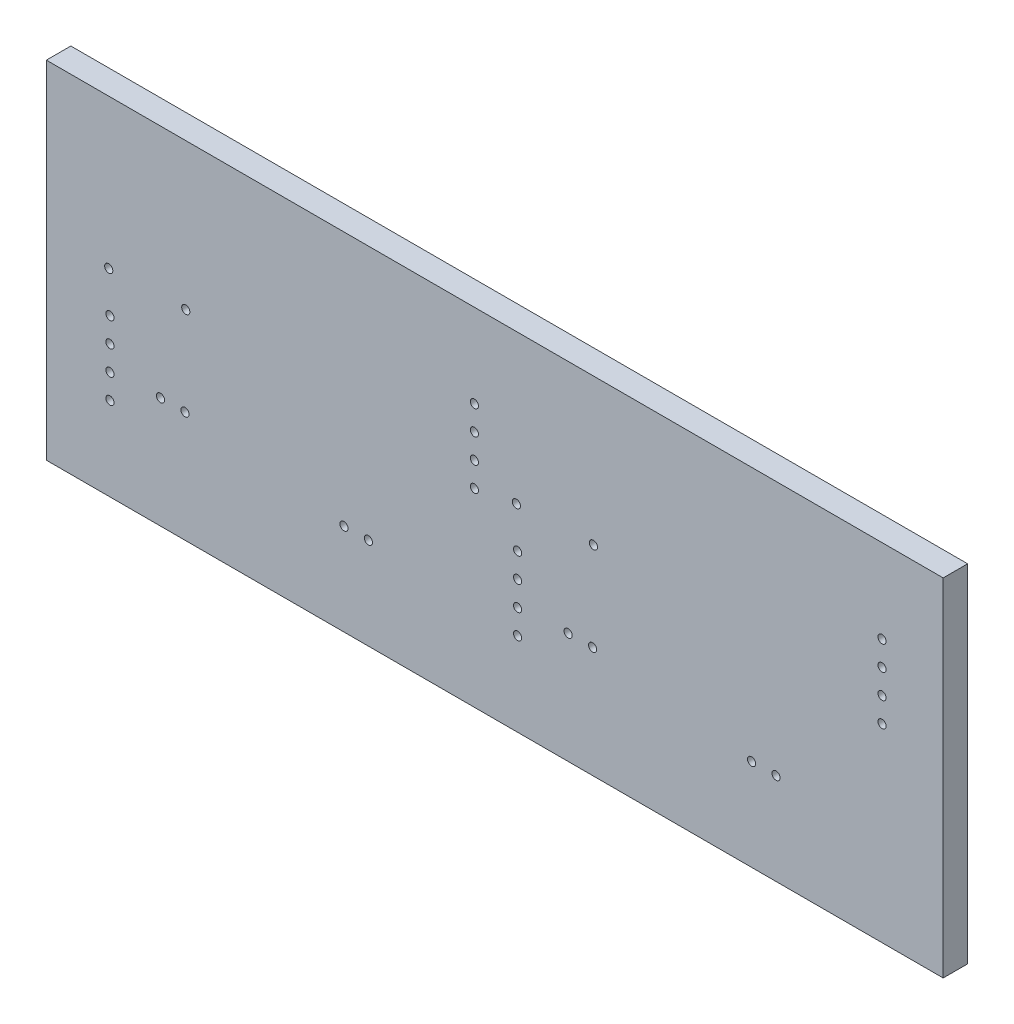
ISO-10303-21;
HEADER;
FILE_DESCRIPTION(('STEP AP214'),'2;1');
FILE_NAME('part.step','',(''),(''),'','','');
FILE_SCHEMA(('AUTOMOTIVE_DESIGN { 1 0 10303 214 1 1 1 1 }'));
ENDSEC;
DATA;
#1=APPLICATION_CONTEXT('core data for automotive mechanical design processes');
#2=APPLICATION_PROTOCOL_DEFINITION('international standard','automotive_design',2000,#1);
#3=PRODUCT_CONTEXT('',#1,'mechanical');
#4=PRODUCT('Part','Part','',(#3));
#5=PRODUCT_RELATED_PRODUCT_CATEGORY('part','',(#4));
#6=PRODUCT_DEFINITION_FORMATION('','',#4);
#7=PRODUCT_DEFINITION_CONTEXT('part definition',#1,'design');
#8=PRODUCT_DEFINITION('design','',#6,#7);
#9=PRODUCT_DEFINITION_SHAPE('','',#8);
#10=(LENGTH_UNIT() NAMED_UNIT(*) SI_UNIT(.MILLI.,.METRE.));
#11=(NAMED_UNIT(*) PLANE_ANGLE_UNIT() SI_UNIT($,.RADIAN.));
#12=(NAMED_UNIT(*) SI_UNIT($,.STERADIAN.) SOLID_ANGLE_UNIT());
#13=UNCERTAINTY_MEASURE_WITH_UNIT(LENGTH_MEASURE(1.E-05),#10,'distance_accuracy_value','');
#14=(GEOMETRIC_REPRESENTATION_CONTEXT(3) GLOBAL_UNCERTAINTY_ASSIGNED_CONTEXT((#13)) GLOBAL_UNIT_ASSIGNED_CONTEXT((#10,
#11,#12)) REPRESENTATION_CONTEXT('',''));
#15=CARTESIAN_POINT('',(0.,0.,0.));
#16=DIRECTION('',(0.,0.,1.));
#17=DIRECTION('',(1.,0.,0.));
#18=AXIS2_PLACEMENT_3D('',#15,#16,#17);
#19=CARTESIAN_POINT('',(0.,0.,6.));
#20=DIRECTION('',(0.,0.,1.));
#21=DIRECTION('',(1.,0.,0.));
#22=AXIS2_PLACEMENT_3D('',#19,#20,#21);
#23=PLANE('',#22);
#24=CARTESIAN_POINT('',(-70.8,49.1,6.));
#25=DIRECTION('',(0.,0.,1.));
#26=DIRECTION('',(1.,0.,0.));
#27=AXIS2_PLACEMENT_3D('',#24,#25,#26);
#28=CIRCLE('',#27,0.999999999999998);
#29=CARTESIAN_POINT('',(-69.8,49.1,6.));
#30=VERTEX_POINT('',#29);
#31=EDGE_CURVE('E268',#30,#30,#28,.T.);
#32=ORIENTED_EDGE('',*,*,#31,.F.);
#33=EDGE_LOOP('',(#32));
#34=FACE_BOUND('',#33,.T.);
#35=CARTESIAN_POINT('',(-89.7,48.4,6.));
#36=DIRECTION('',(0.,0.,1.));
#37=DIRECTION('',(1.,0.,0.));
#38=AXIS2_PLACEMENT_3D('',#35,#36,#37);
#39=CIRCLE('',#38,0.999999999999998);
#40=CARTESIAN_POINT('',(-88.7,48.4,6.));
#41=VERTEX_POINT('',#40);
#42=EDGE_CURVE('E262',#41,#41,#39,.T.);
#43=ORIENTED_EDGE('',*,*,#42,.F.);
#44=EDGE_LOOP('',(#43));
#45=FACE_BOUND('',#44,.T.);
#46=CARTESIAN_POINT('',(-89.4,38.5,6.));
#47=DIRECTION('',(0.,0.,1.));
#48=DIRECTION('',(1.,0.,0.));
#49=AXIS2_PLACEMENT_3D('',#46,#47,#48);
#50=CIRCLE('',#49,0.999999999999998);
#51=CARTESIAN_POINT('',(-88.4,38.5,6.));
#52=VERTEX_POINT('',#51);
#53=EDGE_CURVE('E256',#52,#52,#50,.T.);
#54=ORIENTED_EDGE('',*,*,#53,.F.);
#55=EDGE_LOOP('',(#54));
#56=FACE_BOUND('',#55,.T.);
#57=CARTESIAN_POINT('',(-89.4,32.5,6.));
#58=DIRECTION('',(0.,0.,1.));
#59=DIRECTION('',(1.,0.,0.));
#60=AXIS2_PLACEMENT_3D('',#57,#58,#59);
#61=CIRCLE('',#60,0.999999999999998);
#62=CARTESIAN_POINT('',(-88.4,32.5,6.));
#63=VERTEX_POINT('',#62);
#64=EDGE_CURVE('E250',#63,#63,#61,.T.);
#65=ORIENTED_EDGE('',*,*,#64,.F.);
#66=EDGE_LOOP('',(#65));
#67=FACE_BOUND('',#66,.T.);
#68=CARTESIAN_POINT('',(-89.4,26.5,6.));
#69=DIRECTION('',(0.,0.,1.));
#70=DIRECTION('',(1.,0.,0.));
#71=AXIS2_PLACEMENT_3D('',#68,#69,#70);
#72=CIRCLE('',#71,0.999999999999998);
#73=CARTESIAN_POINT('',(-88.4,26.5,6.));
#74=VERTEX_POINT('',#73);
#75=EDGE_CURVE('E244',#74,#74,#72,.T.);
#76=ORIENTED_EDGE('',*,*,#75,.F.);
#77=EDGE_LOOP('',(#76));
#78=FACE_BOUND('',#77,.T.);
#79=CARTESIAN_POINT('',(-89.4,20.5,6.));
#80=DIRECTION('',(0.,0.,1.));
#81=DIRECTION('',(1.,0.,0.));
#82=AXIS2_PLACEMENT_3D('',#79,#80,#81);
#83=CIRCLE('',#82,0.999999999999998);
#84=CARTESIAN_POINT('',(-88.4,20.5,6.));
#85=VERTEX_POINT('',#84);
#86=EDGE_CURVE('E238',#85,#85,#83,.T.);
#87=ORIENTED_EDGE('',*,*,#86,.F.);
#88=EDGE_LOOP('',(#87));
#89=FACE_BOUND('',#88,.T.);
#90=CARTESIAN_POINT('',(-77.,27.2360668502613,6.));
#91=DIRECTION('',(0.,0.,1.));
#92=DIRECTION('',(1.,0.,0.));
#93=AXIS2_PLACEMENT_3D('',#90,#91,#92);
#94=CIRCLE('',#93,0.999999999999998);
#95=CARTESIAN_POINT('',(-76.,27.2360668502613,6.));
#96=VERTEX_POINT('',#95);
#97=EDGE_CURVE('E232',#96,#96,#94,.T.);
#98=ORIENTED_EDGE('',*,*,#97,.F.);
#99=EDGE_LOOP('',(#98));
#100=FACE_BOUND('',#99,.T.);
#101=CARTESIAN_POINT('',(-71.,27.2360668502613,6.));
#102=DIRECTION('',(0.,0.,1.));
#103=DIRECTION('',(1.,0.,0.));
#104=AXIS2_PLACEMENT_3D('',#101,#102,#103);
#105=CIRCLE('',#104,0.999999999999998);
#106=CARTESIAN_POINT('',(-70.,27.2360668502613,6.));
#107=VERTEX_POINT('',#106);
#108=EDGE_CURVE('E226',#107,#107,#105,.T.);
#109=ORIENTED_EDGE('',*,*,#108,.F.);
#110=EDGE_LOOP('',(#109));
#111=FACE_BOUND('',#110,.T.);
#112=CARTESIAN_POINT('',(-32.,22.5,6.));
#113=DIRECTION('',(0.,0.,1.));
#114=DIRECTION('',(1.,0.,0.));
#115=AXIS2_PLACEMENT_3D('',#112,#113,#114);
#116=CIRCLE('',#115,0.999999999999998);
#117=CARTESIAN_POINT('',(-31.,22.5,6.));
#118=VERTEX_POINT('',#117);
#119=EDGE_CURVE('E220',#118,#118,#116,.T.);
#120=ORIENTED_EDGE('',*,*,#119,.F.);
#121=EDGE_LOOP('',(#120));
#122=FACE_BOUND('',#121,.T.);
#123=CARTESIAN_POINT('',(-26.,22.5,6.));
#124=DIRECTION('',(0.,0.,1.));
#125=DIRECTION('',(1.,0.,0.));
#126=AXIS2_PLACEMENT_3D('',#123,#124,#125);
#127=CIRCLE('',#126,0.999999999999998);
#128=CARTESIAN_POINT('',(-25.,22.5,6.));
#129=VERTEX_POINT('',#128);
#130=EDGE_CURVE('E214',#129,#129,#127,.T.);
#131=ORIENTED_EDGE('',*,*,#130,.F.);
#132=EDGE_LOOP('',(#131));
#133=FACE_BOUND('',#132,.T.);
#134=CARTESIAN_POINT('',(0.,46.5,6.));
#135=DIRECTION('',(0.,0.,1.));
#136=DIRECTION('',(1.,0.,0.));
#137=AXIS2_PLACEMENT_3D('',#134,#135,#136);
#138=CIRCLE('',#137,1.);
#139=CARTESIAN_POINT('',(1.00000000000001,46.5,6.));
#140=VERTEX_POINT('',#139);
#141=EDGE_CURVE('E208',#140,#140,#138,.T.);
#142=ORIENTED_EDGE('',*,*,#141,.F.);
#143=EDGE_LOOP('',(#142));
#144=FACE_BOUND('',#143,.T.);
#145=CARTESIAN_POINT('',(0.,52.5,6.));
#146=DIRECTION('',(0.,0.,1.));
#147=DIRECTION('',(1.,0.,0.));
#148=AXIS2_PLACEMENT_3D('',#145,#146,#147);
#149=CIRCLE('',#148,1.);
#150=CARTESIAN_POINT('',(1.00000000000001,52.5,6.));
#151=VERTEX_POINT('',#150);
#152=EDGE_CURVE('E202',#151,#151,#149,.T.);
#153=ORIENTED_EDGE('',*,*,#152,.F.);
#154=EDGE_LOOP('',(#153));
#155=FACE_BOUND('',#154,.T.);
#156=CARTESIAN_POINT('',(0.,58.5,6.));
#157=DIRECTION('',(0.,0.,1.));
#158=DIRECTION('',(1.,0.,0.));
#159=AXIS2_PLACEMENT_3D('',#156,#157,#158);
#160=CIRCLE('',#159,1.);
#161=CARTESIAN_POINT('',(1.00000000000001,58.5,6.));
#162=VERTEX_POINT('',#161);
#163=EDGE_CURVE('E196',#162,#162,#160,.T.);
#164=ORIENTED_EDGE('',*,*,#163,.F.);
#165=EDGE_LOOP('',(#164));
#166=FACE_BOUND('',#165,.T.);
#167=CARTESIAN_POINT('',(0.,64.5,6.));
#168=DIRECTION('',(0.,0.,1.));
#169=DIRECTION('',(1.,0.,0.));
#170=AXIS2_PLACEMENT_3D('',#167,#168,#169);
#171=CIRCLE('',#170,1.);
#172=CARTESIAN_POINT('',(1.00000000000002,64.5,6.));
#173=VERTEX_POINT('',#172);
#174=EDGE_CURVE('E190',#173,#173,#171,.T.);
#175=ORIENTED_EDGE('',*,*,#174,.F.);
#176=EDGE_LOOP('',(#175));
#177=FACE_BOUND('',#176,.T.);
#178=CARTESIAN_POINT('',(29.2,49.1,6.));
#179=DIRECTION('',(0.,0.,1.));
#180=DIRECTION('',(1.,0.,0.));
#181=AXIS2_PLACEMENT_3D('',#178,#179,#180);
#182=CIRCLE('',#181,0.999999999999998);
#183=CARTESIAN_POINT('',(30.2,49.1,6.));
#184=VERTEX_POINT('',#183);
#185=EDGE_CURVE('E184',#184,#184,#182,.T.);
#186=ORIENTED_EDGE('',*,*,#185,.F.);
#187=EDGE_LOOP('',(#186));
#188=FACE_BOUND('',#187,.T.);
#189=CARTESIAN_POINT('',(10.3,48.4,6.));
#190=DIRECTION('',(0.,0.,1.));
#191=DIRECTION('',(1.,0.,0.));
#192=AXIS2_PLACEMENT_3D('',#189,#190,#191);
#193=CIRCLE('',#192,0.999999999999998);
#194=CARTESIAN_POINT('',(11.3,48.4,6.));
#195=VERTEX_POINT('',#194);
#196=EDGE_CURVE('E178',#195,#195,#193,.T.);
#197=ORIENTED_EDGE('',*,*,#196,.F.);
#198=EDGE_LOOP('',(#197));
#199=FACE_BOUND('',#198,.T.);
#200=CARTESIAN_POINT('',(10.6,38.5,6.));
#201=DIRECTION('',(0.,0.,1.));
#202=DIRECTION('',(1.,0.,0.));
#203=AXIS2_PLACEMENT_3D('',#200,#201,#202);
#204=CIRCLE('',#203,0.999999999999998);
#205=CARTESIAN_POINT('',(11.6,38.5,6.));
#206=VERTEX_POINT('',#205);
#207=EDGE_CURVE('E172',#206,#206,#204,.T.);
#208=ORIENTED_EDGE('',*,*,#207,.F.);
#209=EDGE_LOOP('',(#208));
#210=FACE_BOUND('',#209,.T.);
#211=CARTESIAN_POINT('',(10.6,32.5,6.));
#212=DIRECTION('',(0.,0.,1.));
#213=DIRECTION('',(1.,0.,0.));
#214=AXIS2_PLACEMENT_3D('',#211,#212,#213);
#215=CIRCLE('',#214,0.999999999999998);
#216=CARTESIAN_POINT('',(11.6,32.5,6.));
#217=VERTEX_POINT('',#216);
#218=EDGE_CURVE('E166',#217,#217,#215,.T.);
#219=ORIENTED_EDGE('',*,*,#218,.F.);
#220=EDGE_LOOP('',(#219));
#221=FACE_BOUND('',#220,.T.);
#222=CARTESIAN_POINT('',(10.6,26.5,6.));
#223=DIRECTION('',(0.,0.,1.));
#224=DIRECTION('',(1.,0.,0.));
#225=AXIS2_PLACEMENT_3D('',#222,#223,#224);
#226=CIRCLE('',#225,0.999999999999998);
#227=CARTESIAN_POINT('',(11.6,26.5,6.));
#228=VERTEX_POINT('',#227);
#229=EDGE_CURVE('E160',#228,#228,#226,.T.);
#230=ORIENTED_EDGE('',*,*,#229,.F.);
#231=EDGE_LOOP('',(#230));
#232=FACE_BOUND('',#231,.T.);
#233=CARTESIAN_POINT('',(10.6,20.5,6.));
#234=DIRECTION('',(0.,0.,1.));
#235=DIRECTION('',(1.,0.,0.));
#236=AXIS2_PLACEMENT_3D('',#233,#234,#235);
#237=CIRCLE('',#236,0.999999999999998);
#238=CARTESIAN_POINT('',(11.6,20.5,6.));
#239=VERTEX_POINT('',#238);
#240=EDGE_CURVE('E154',#239,#239,#237,.T.);
#241=ORIENTED_EDGE('',*,*,#240,.F.);
#242=EDGE_LOOP('',(#241));
#243=FACE_BOUND('',#242,.T.);
#244=CARTESIAN_POINT('',(23.,27.2360668502613,6.));
#245=DIRECTION('',(0.,0.,1.));
#246=DIRECTION('',(1.,0.,0.));
#247=AXIS2_PLACEMENT_3D('',#244,#245,#246);
#248=CIRCLE('',#247,0.999999999999998);
#249=CARTESIAN_POINT('',(24.,27.2360668502613,6.));
#250=VERTEX_POINT('',#249);
#251=EDGE_CURVE('E148',#250,#250,#248,.T.);
#252=ORIENTED_EDGE('',*,*,#251,.F.);
#253=EDGE_LOOP('',(#252));
#254=FACE_BOUND('',#253,.T.);
#255=CARTESIAN_POINT('',(29.,27.2360668502613,6.));
#256=DIRECTION('',(0.,0.,1.));
#257=DIRECTION('',(1.,0.,0.));
#258=AXIS2_PLACEMENT_3D('',#255,#256,#257);
#259=CIRCLE('',#258,0.999999999999998);
#260=CARTESIAN_POINT('',(30.,27.2360668502613,6.));
#261=VERTEX_POINT('',#260);
#262=EDGE_CURVE('E142',#261,#261,#259,.T.);
#263=ORIENTED_EDGE('',*,*,#262,.F.);
#264=EDGE_LOOP('',(#263));
#265=FACE_BOUND('',#264,.T.);
#266=CARTESIAN_POINT('',(68.,22.5,6.));
#267=DIRECTION('',(0.,0.,1.));
#268=DIRECTION('',(1.,0.,0.));
#269=AXIS2_PLACEMENT_3D('',#266,#267,#268);
#270=CIRCLE('',#269,0.999999999999998);
#271=CARTESIAN_POINT('',(69.,22.5,6.));
#272=VERTEX_POINT('',#271);
#273=EDGE_CURVE('E136',#272,#272,#270,.T.);
#274=ORIENTED_EDGE('',*,*,#273,.F.);
#275=EDGE_LOOP('',(#274));
#276=FACE_BOUND('',#275,.T.);
#277=CARTESIAN_POINT('',(74.,22.5,6.));
#278=DIRECTION('',(0.,0.,1.));
#279=DIRECTION('',(1.,0.,0.));
#280=AXIS2_PLACEMENT_3D('',#277,#278,#279);
#281=CIRCLE('',#280,0.999999999999998);
#282=CARTESIAN_POINT('',(75.,22.5,6.));
#283=VERTEX_POINT('',#282);
#284=EDGE_CURVE('E130',#283,#283,#281,.T.);
#285=ORIENTED_EDGE('',*,*,#284,.F.);
#286=EDGE_LOOP('',(#285));
#287=FACE_BOUND('',#286,.T.);
#288=CARTESIAN_POINT('',(100.,46.5,6.));
#289=DIRECTION('',(0.,0.,1.));
#290=DIRECTION('',(1.,0.,0.));
#291=AXIS2_PLACEMENT_3D('',#288,#289,#290);
#292=CIRCLE('',#291,0.999999999999998);
#293=CARTESIAN_POINT('',(101.,46.5,6.));
#294=VERTEX_POINT('',#293);
#295=EDGE_CURVE('E124',#294,#294,#292,.T.);
#296=ORIENTED_EDGE('',*,*,#295,.F.);
#297=EDGE_LOOP('',(#296));
#298=FACE_BOUND('',#297,.T.);
#299=CARTESIAN_POINT('',(100.,52.5,6.));
#300=DIRECTION('',(0.,0.,1.));
#301=DIRECTION('',(1.,0.,0.));
#302=AXIS2_PLACEMENT_3D('',#299,#300,#301);
#303=CIRCLE('',#302,0.999999999999998);
#304=CARTESIAN_POINT('',(101.,52.5,6.));
#305=VERTEX_POINT('',#304);
#306=EDGE_CURVE('E118',#305,#305,#303,.T.);
#307=ORIENTED_EDGE('',*,*,#306,.F.);
#308=EDGE_LOOP('',(#307));
#309=FACE_BOUND('',#308,.T.);
#310=CARTESIAN_POINT('',(100.,58.5,6.));
#311=DIRECTION('',(0.,0.,1.));
#312=DIRECTION('',(1.,0.,0.));
#313=AXIS2_PLACEMENT_3D('',#310,#311,#312);
#314=CIRCLE('',#313,0.999999999999998);
#315=CARTESIAN_POINT('',(101.,58.5,6.));
#316=VERTEX_POINT('',#315);
#317=EDGE_CURVE('E112',#316,#316,#314,.T.);
#318=ORIENTED_EDGE('',*,*,#317,.F.);
#319=EDGE_LOOP('',(#318));
#320=FACE_BOUND('',#319,.T.);
#321=CARTESIAN_POINT('',(100.,64.5,6.));
#322=DIRECTION('',(0.,0.,1.));
#323=DIRECTION('',(1.,0.,0.));
#324=AXIS2_PLACEMENT_3D('',#321,#322,#323);
#325=CIRCLE('',#324,0.999999999999998);
#326=CARTESIAN_POINT('',(101.,64.5,6.));
#327=VERTEX_POINT('',#326);
#328=EDGE_CURVE('E109',#327,#327,#325,.T.);
#329=ORIENTED_EDGE('',*,*,#328,.F.);
#330=EDGE_LOOP('',(#329));
#331=FACE_BOUND('',#330,.T.);
#332=DIRECTION('',(0.,1.,0.));
#333=VECTOR('',#332,1.);
#334=CARTESIAN_POINT('',(-105.,85.,6.));
#335=LINE('',#334,#333);
#336=CARTESIAN_POINT('',(-105.,0.,6.));
#337=VERTEX_POINT('',#336);
#338=CARTESIAN_POINT('',(-105.,85.,6.));
#339=VERTEX_POINT('',#338);
#340=EDGE_CURVE('E98',#337,#339,#335,.T.);
#341=ORIENTED_EDGE('',*,*,#340,.F.);
#342=DIRECTION('',(-1.,0.,0.));
#343=VECTOR('',#342,1.);
#344=CARTESIAN_POINT('',(-200.096815270482,0.,6.));
#345=LINE('',#344,#343);
#346=CARTESIAN_POINT('',(115.,0.,6.));
#347=VERTEX_POINT('',#346);
#348=EDGE_CURVE('E11',#347,#337,#345,.T.);
#349=ORIENTED_EDGE('',*,*,#348,.F.);
#350=DIRECTION('',(0.,-1.,0.));
#351=VECTOR('',#350,1.);
#352=CARTESIAN_POINT('',(115.,0.,6.));
#353=LINE('',#352,#351);
#354=CARTESIAN_POINT('',(115.,85.,6.));
#355=VERTEX_POINT('',#354);
#356=EDGE_CURVE('E49',#355,#347,#353,.T.);
#357=ORIENTED_EDGE('',*,*,#356,.F.);
#358=DIRECTION('',(1.,0.,0.));
#359=VECTOR('',#358,1.);
#360=CARTESIAN_POINT('',(115.,85.,6.));
#361=LINE('',#360,#359);
#362=EDGE_CURVE('E104',#339,#355,#361,.T.);
#363=ORIENTED_EDGE('',*,*,#362,.F.);
#364=EDGE_LOOP('',(#341,#349,#357,#363));
#365=FACE_BOUND('',#364,.T.);
#366=ADVANCED_FACE('F35',(#34,#45,#56,#67,#78,#89,#100,#111,#122,#133,#144,#155,#166,#177,#188,
#199,#210,#221,#232,#243,#254,#265,#276,#287,#298,#309,#320,#331,#365),#23,.T.);
#367=CARTESIAN_POINT('',(-200.096815270482,0.,0.));
#368=DIRECTION('',(0.,1.,0.));
#369=DIRECTION('',(0.,0.,1.));
#370=AXIS2_PLACEMENT_3D('',#367,#368,#369);
#371=PLANE('',#370);
#372=ORIENTED_EDGE('',*,*,#348,.T.);
#373=DIRECTION('',(0.,0.,1.));
#374=VECTOR('',#373,1.);
#375=CARTESIAN_POINT('',(-105.,0.,0.));
#376=LINE('',#375,#374);
#377=CARTESIAN_POINT('',(-105.,0.,0.));
#378=VERTEX_POINT('',#377);
#379=EDGE_CURVE('E84',#378,#337,#376,.T.);
#380=ORIENTED_EDGE('',*,*,#379,.F.);
#381=DIRECTION('',(-1.,0.,0.));
#382=VECTOR('',#381,1.);
#383=CARTESIAN_POINT('',(-200.096815270482,0.,0.));
#384=LINE('',#383,#382);
#385=CARTESIAN_POINT('',(115.,0.,0.));
#386=VERTEX_POINT('',#385);
#387=EDGE_CURVE('E38',#386,#378,#384,.T.);
#388=ORIENTED_EDGE('',*,*,#387,.F.);
#389=DIRECTION('',(0.,0.,1.));
#390=VECTOR('',#389,1.);
#391=CARTESIAN_POINT('',(115.,0.,0.));
#392=LINE('',#391,#390);
#393=EDGE_CURVE('E76',#386,#347,#392,.T.);
#394=ORIENTED_EDGE('',*,*,#393,.T.);
#395=EDGE_LOOP('',(#372,#380,#388,#394));
#396=FACE_BOUND('',#395,.T.);
#397=ADVANCED_FACE('F94',(#396),#371,.F.);
#398=CARTESIAN_POINT('',(115.,85.,0.));
#399=DIRECTION('',(0.,-1.,0.));
#400=DIRECTION('',(1.,0.,0.));
#401=AXIS2_PLACEMENT_3D('',#398,#399,#400);
#402=PLANE('',#401);
#403=ORIENTED_EDGE('',*,*,#362,.T.);
#404=DIRECTION('',(0.,0.,1.));
#405=VECTOR('',#404,1.);
#406=CARTESIAN_POINT('',(115.,85.,0.));
#407=LINE('',#406,#405);
#408=CARTESIAN_POINT('',(115.,85.,0.));
#409=VERTEX_POINT('',#408);
#410=EDGE_CURVE('E74',#409,#355,#407,.T.);
#411=ORIENTED_EDGE('',*,*,#410,.F.);
#412=DIRECTION('',(1.,0.,0.));
#413=VECTOR('',#412,1.);
#414=CARTESIAN_POINT('',(115.,85.,0.));
#415=LINE('',#414,#413);
#416=CARTESIAN_POINT('',(-105.,85.,0.));
#417=VERTEX_POINT('',#416);
#418=EDGE_CURVE('E90',#417,#409,#415,.T.);
#419=ORIENTED_EDGE('',*,*,#418,.F.);
#420=DIRECTION('',(0.,0.,1.));
#421=VECTOR('',#420,1.);
#422=CARTESIAN_POINT('',(-105.,85.,0.));
#423=LINE('',#422,#421);
#424=EDGE_CURVE('E58',#417,#339,#423,.T.);
#425=ORIENTED_EDGE('',*,*,#424,.T.);
#426=EDGE_LOOP('',(#403,#411,#419,#425));
#427=FACE_BOUND('',#426,.T.);
#428=ADVANCED_FACE('F335',(#427),#402,.F.);
#429=CARTESIAN_POINT('',(-105.,85.,0.));
#430=DIRECTION('',(1.,0.,0.));
#431=DIRECTION('',(0.,0.,-1.));
#432=AXIS2_PLACEMENT_3D('',#429,#430,#431);
#433=PLANE('',#432);
#434=ORIENTED_EDGE('',*,*,#340,.T.);
#435=ORIENTED_EDGE('',*,*,#424,.F.);
#436=DIRECTION('',(0.,1.,0.));
#437=VECTOR('',#436,1.);
#438=CARTESIAN_POINT('',(-105.,85.,0.));
#439=LINE('',#438,#437);
#440=EDGE_CURVE('E91',#378,#417,#439,.T.);
#441=ORIENTED_EDGE('',*,*,#440,.F.);
#442=ORIENTED_EDGE('',*,*,#379,.T.);
#443=EDGE_LOOP('',(#434,#435,#441,#442));
#444=FACE_BOUND('',#443,.T.);
#445=ADVANCED_FACE('F337',(#444),#433,.F.);
#446=CARTESIAN_POINT('',(115.,0.,0.));
#447=DIRECTION('',(-1.,0.,0.));
#448=DIRECTION('',(0.,0.,1.));
#449=AXIS2_PLACEMENT_3D('',#446,#447,#448);
#450=PLANE('',#449);
#451=ORIENTED_EDGE('',*,*,#356,.T.);
#452=ORIENTED_EDGE('',*,*,#393,.F.);
#453=DIRECTION('',(0.,-1.,0.));
#454=VECTOR('',#453,1.);
#455=CARTESIAN_POINT('',(115.,0.,0.));
#456=LINE('',#455,#454);
#457=EDGE_CURVE('E79',#409,#386,#456,.T.);
#458=ORIENTED_EDGE('',*,*,#457,.F.);
#459=ORIENTED_EDGE('',*,*,#410,.T.);
#460=EDGE_LOOP('',(#451,#452,#458,#459));
#461=FACE_BOUND('',#460,.T.);
#462=ADVANCED_FACE('F78',(#461),#450,.F.);
#463=CARTESIAN_POINT('',(0.,0.,0.));
#464=DIRECTION('',(0.,0.,1.));
#465=DIRECTION('',(1.,0.,0.));
#466=AXIS2_PLACEMENT_3D('',#463,#464,#465);
#467=PLANE('',#466);
#468=CARTESIAN_POINT('',(-70.8,49.1,0.));
#469=DIRECTION('',(0.,0.,1.));
#470=DIRECTION('',(1.,0.,0.));
#471=AXIS2_PLACEMENT_3D('',#468,#469,#470);
#472=CIRCLE('',#471,0.999999999999998);
#473=CARTESIAN_POINT('',(-69.8,49.1,0.));
#474=VERTEX_POINT('',#473);
#475=EDGE_CURVE('E271',#474,#474,#472,.T.);
#476=ORIENTED_EDGE('',*,*,#475,.T.);
#477=EDGE_LOOP('',(#476));
#478=FACE_BOUND('',#477,.T.);
#479=CARTESIAN_POINT('',(-89.7,48.4,0.));
#480=DIRECTION('',(0.,0.,1.));
#481=DIRECTION('',(1.,0.,0.));
#482=AXIS2_PLACEMENT_3D('',#479,#480,#481);
#483=CIRCLE('',#482,0.999999999999998);
#484=CARTESIAN_POINT('',(-88.7,48.4,0.));
#485=VERTEX_POINT('',#484);
#486=EDGE_CURVE('E265',#485,#485,#483,.T.);
#487=ORIENTED_EDGE('',*,*,#486,.T.);
#488=EDGE_LOOP('',(#487));
#489=FACE_BOUND('',#488,.T.);
#490=CARTESIAN_POINT('',(-89.4,38.5,0.));
#491=DIRECTION('',(0.,0.,1.));
#492=DIRECTION('',(1.,0.,0.));
#493=AXIS2_PLACEMENT_3D('',#490,#491,#492);
#494=CIRCLE('',#493,0.999999999999998);
#495=CARTESIAN_POINT('',(-88.4,38.5,0.));
#496=VERTEX_POINT('',#495);
#497=EDGE_CURVE('E259',#496,#496,#494,.T.);
#498=ORIENTED_EDGE('',*,*,#497,.T.);
#499=EDGE_LOOP('',(#498));
#500=FACE_BOUND('',#499,.T.);
#501=CARTESIAN_POINT('',(-89.4,32.5,0.));
#502=DIRECTION('',(0.,0.,1.));
#503=DIRECTION('',(1.,0.,0.));
#504=AXIS2_PLACEMENT_3D('',#501,#502,#503);
#505=CIRCLE('',#504,0.999999999999998);
#506=CARTESIAN_POINT('',(-88.4,32.5,0.));
#507=VERTEX_POINT('',#506);
#508=EDGE_CURVE('E253',#507,#507,#505,.T.);
#509=ORIENTED_EDGE('',*,*,#508,.T.);
#510=EDGE_LOOP('',(#509));
#511=FACE_BOUND('',#510,.T.);
#512=CARTESIAN_POINT('',(-89.4,26.5,0.));
#513=DIRECTION('',(0.,0.,1.));
#514=DIRECTION('',(1.,0.,0.));
#515=AXIS2_PLACEMENT_3D('',#512,#513,#514);
#516=CIRCLE('',#515,0.999999999999998);
#517=CARTESIAN_POINT('',(-88.4,26.5,0.));
#518=VERTEX_POINT('',#517);
#519=EDGE_CURVE('E247',#518,#518,#516,.T.);
#520=ORIENTED_EDGE('',*,*,#519,.T.);
#521=EDGE_LOOP('',(#520));
#522=FACE_BOUND('',#521,.T.);
#523=CARTESIAN_POINT('',(-89.4,20.5,0.));
#524=DIRECTION('',(0.,0.,1.));
#525=DIRECTION('',(1.,0.,0.));
#526=AXIS2_PLACEMENT_3D('',#523,#524,#525);
#527=CIRCLE('',#526,0.999999999999998);
#528=CARTESIAN_POINT('',(-88.4,20.5,0.));
#529=VERTEX_POINT('',#528);
#530=EDGE_CURVE('E241',#529,#529,#527,.T.);
#531=ORIENTED_EDGE('',*,*,#530,.T.);
#532=EDGE_LOOP('',(#531));
#533=FACE_BOUND('',#532,.T.);
#534=CARTESIAN_POINT('',(-77.,27.2360668502613,0.));
#535=DIRECTION('',(0.,0.,1.));
#536=DIRECTION('',(1.,0.,0.));
#537=AXIS2_PLACEMENT_3D('',#534,#535,#536);
#538=CIRCLE('',#537,0.999999999999998);
#539=CARTESIAN_POINT('',(-76.,27.2360668502613,0.));
#540=VERTEX_POINT('',#539);
#541=EDGE_CURVE('E235',#540,#540,#538,.T.);
#542=ORIENTED_EDGE('',*,*,#541,.T.);
#543=EDGE_LOOP('',(#542));
#544=FACE_BOUND('',#543,.T.);
#545=CARTESIAN_POINT('',(-71.,27.2360668502613,0.));
#546=DIRECTION('',(0.,0.,1.));
#547=DIRECTION('',(1.,0.,0.));
#548=AXIS2_PLACEMENT_3D('',#545,#546,#547);
#549=CIRCLE('',#548,0.999999999999998);
#550=CARTESIAN_POINT('',(-70.,27.2360668502613,0.));
#551=VERTEX_POINT('',#550);
#552=EDGE_CURVE('E229',#551,#551,#549,.T.);
#553=ORIENTED_EDGE('',*,*,#552,.T.);
#554=EDGE_LOOP('',(#553));
#555=FACE_BOUND('',#554,.T.);
#556=CARTESIAN_POINT('',(-32.,22.5,0.));
#557=DIRECTION('',(0.,0.,1.));
#558=DIRECTION('',(1.,0.,0.));
#559=AXIS2_PLACEMENT_3D('',#556,#557,#558);
#560=CIRCLE('',#559,0.999999999999998);
#561=CARTESIAN_POINT('',(-31.,22.5,0.));
#562=VERTEX_POINT('',#561);
#563=EDGE_CURVE('E223',#562,#562,#560,.T.);
#564=ORIENTED_EDGE('',*,*,#563,.T.);
#565=EDGE_LOOP('',(#564));
#566=FACE_BOUND('',#565,.T.);
#567=CARTESIAN_POINT('',(-26.,22.5,0.));
#568=DIRECTION('',(0.,0.,1.));
#569=DIRECTION('',(1.,0.,0.));
#570=AXIS2_PLACEMENT_3D('',#567,#568,#569);
#571=CIRCLE('',#570,0.999999999999998);
#572=CARTESIAN_POINT('',(-25.,22.5,0.));
#573=VERTEX_POINT('',#572);
#574=EDGE_CURVE('E217',#573,#573,#571,.T.);
#575=ORIENTED_EDGE('',*,*,#574,.T.);
#576=EDGE_LOOP('',(#575));
#577=FACE_BOUND('',#576,.T.);
#578=CARTESIAN_POINT('',(0.,46.5,0.));
#579=DIRECTION('',(0.,0.,1.));
#580=DIRECTION('',(1.,0.,0.));
#581=AXIS2_PLACEMENT_3D('',#578,#579,#580);
#582=CIRCLE('',#581,1.);
#583=CARTESIAN_POINT('',(1.00000000000001,46.5,0.));
#584=VERTEX_POINT('',#583);
#585=EDGE_CURVE('E211',#584,#584,#582,.T.);
#586=ORIENTED_EDGE('',*,*,#585,.T.);
#587=EDGE_LOOP('',(#586));
#588=FACE_BOUND('',#587,.T.);
#589=CARTESIAN_POINT('',(0.,52.5,0.));
#590=DIRECTION('',(0.,0.,1.));
#591=DIRECTION('',(1.,0.,0.));
#592=AXIS2_PLACEMENT_3D('',#589,#590,#591);
#593=CIRCLE('',#592,1.);
#594=CARTESIAN_POINT('',(1.00000000000001,52.5,0.));
#595=VERTEX_POINT('',#594);
#596=EDGE_CURVE('E205',#595,#595,#593,.T.);
#597=ORIENTED_EDGE('',*,*,#596,.T.);
#598=EDGE_LOOP('',(#597));
#599=FACE_BOUND('',#598,.T.);
#600=CARTESIAN_POINT('',(0.,58.5,0.));
#601=DIRECTION('',(0.,0.,1.));
#602=DIRECTION('',(1.,0.,0.));
#603=AXIS2_PLACEMENT_3D('',#600,#601,#602);
#604=CIRCLE('',#603,1.);
#605=CARTESIAN_POINT('',(1.00000000000001,58.5,0.));
#606=VERTEX_POINT('',#605);
#607=EDGE_CURVE('E199',#606,#606,#604,.T.);
#608=ORIENTED_EDGE('',*,*,#607,.T.);
#609=EDGE_LOOP('',(#608));
#610=FACE_BOUND('',#609,.T.);
#611=CARTESIAN_POINT('',(0.,64.5,0.));
#612=DIRECTION('',(0.,0.,1.));
#613=DIRECTION('',(1.,0.,0.));
#614=AXIS2_PLACEMENT_3D('',#611,#612,#613);
#615=CIRCLE('',#614,1.);
#616=CARTESIAN_POINT('',(1.00000000000002,64.5,0.));
#617=VERTEX_POINT('',#616);
#618=EDGE_CURVE('E193',#617,#617,#615,.T.);
#619=ORIENTED_EDGE('',*,*,#618,.T.);
#620=EDGE_LOOP('',(#619));
#621=FACE_BOUND('',#620,.T.);
#622=CARTESIAN_POINT('',(29.2,49.1,0.));
#623=DIRECTION('',(0.,0.,1.));
#624=DIRECTION('',(1.,0.,0.));
#625=AXIS2_PLACEMENT_3D('',#622,#623,#624);
#626=CIRCLE('',#625,0.999999999999998);
#627=CARTESIAN_POINT('',(30.2,49.1,0.));
#628=VERTEX_POINT('',#627);
#629=EDGE_CURVE('E187',#628,#628,#626,.T.);
#630=ORIENTED_EDGE('',*,*,#629,.T.);
#631=EDGE_LOOP('',(#630));
#632=FACE_BOUND('',#631,.T.);
#633=CARTESIAN_POINT('',(10.3,48.4,0.));
#634=DIRECTION('',(0.,0.,1.));
#635=DIRECTION('',(1.,0.,0.));
#636=AXIS2_PLACEMENT_3D('',#633,#634,#635);
#637=CIRCLE('',#636,0.999999999999998);
#638=CARTESIAN_POINT('',(11.3,48.4,0.));
#639=VERTEX_POINT('',#638);
#640=EDGE_CURVE('E181',#639,#639,#637,.T.);
#641=ORIENTED_EDGE('',*,*,#640,.T.);
#642=EDGE_LOOP('',(#641));
#643=FACE_BOUND('',#642,.T.);
#644=CARTESIAN_POINT('',(10.6,38.5,0.));
#645=DIRECTION('',(0.,0.,1.));
#646=DIRECTION('',(1.,0.,0.));
#647=AXIS2_PLACEMENT_3D('',#644,#645,#646);
#648=CIRCLE('',#647,0.999999999999998);
#649=CARTESIAN_POINT('',(11.6,38.5,0.));
#650=VERTEX_POINT('',#649);
#651=EDGE_CURVE('E175',#650,#650,#648,.T.);
#652=ORIENTED_EDGE('',*,*,#651,.T.);
#653=EDGE_LOOP('',(#652));
#654=FACE_BOUND('',#653,.T.);
#655=CARTESIAN_POINT('',(10.6,32.5,0.));
#656=DIRECTION('',(0.,0.,1.));
#657=DIRECTION('',(1.,0.,0.));
#658=AXIS2_PLACEMENT_3D('',#655,#656,#657);
#659=CIRCLE('',#658,0.999999999999998);
#660=CARTESIAN_POINT('',(11.6,32.5,0.));
#661=VERTEX_POINT('',#660);
#662=EDGE_CURVE('E169',#661,#661,#659,.T.);
#663=ORIENTED_EDGE('',*,*,#662,.T.);
#664=EDGE_LOOP('',(#663));
#665=FACE_BOUND('',#664,.T.);
#666=CARTESIAN_POINT('',(10.6,26.5,0.));
#667=DIRECTION('',(0.,0.,1.));
#668=DIRECTION('',(1.,0.,0.));
#669=AXIS2_PLACEMENT_3D('',#666,#667,#668);
#670=CIRCLE('',#669,0.999999999999998);
#671=CARTESIAN_POINT('',(11.6,26.5,0.));
#672=VERTEX_POINT('',#671);
#673=EDGE_CURVE('E163',#672,#672,#670,.T.);
#674=ORIENTED_EDGE('',*,*,#673,.T.);
#675=EDGE_LOOP('',(#674));
#676=FACE_BOUND('',#675,.T.);
#677=CARTESIAN_POINT('',(10.6,20.5,0.));
#678=DIRECTION('',(0.,0.,1.));
#679=DIRECTION('',(1.,0.,0.));
#680=AXIS2_PLACEMENT_3D('',#677,#678,#679);
#681=CIRCLE('',#680,0.999999999999998);
#682=CARTESIAN_POINT('',(11.6,20.5,0.));
#683=VERTEX_POINT('',#682);
#684=EDGE_CURVE('E157',#683,#683,#681,.T.);
#685=ORIENTED_EDGE('',*,*,#684,.T.);
#686=EDGE_LOOP('',(#685));
#687=FACE_BOUND('',#686,.T.);
#688=CARTESIAN_POINT('',(23.,27.2360668502613,0.));
#689=DIRECTION('',(0.,0.,1.));
#690=DIRECTION('',(1.,0.,0.));
#691=AXIS2_PLACEMENT_3D('',#688,#689,#690);
#692=CIRCLE('',#691,0.999999999999998);
#693=CARTESIAN_POINT('',(24.,27.2360668502613,0.));
#694=VERTEX_POINT('',#693);
#695=EDGE_CURVE('E151',#694,#694,#692,.T.);
#696=ORIENTED_EDGE('',*,*,#695,.T.);
#697=EDGE_LOOP('',(#696));
#698=FACE_BOUND('',#697,.T.);
#699=CARTESIAN_POINT('',(29.,27.2360668502613,0.));
#700=DIRECTION('',(0.,0.,1.));
#701=DIRECTION('',(1.,0.,0.));
#702=AXIS2_PLACEMENT_3D('',#699,#700,#701);
#703=CIRCLE('',#702,0.999999999999998);
#704=CARTESIAN_POINT('',(30.,27.2360668502613,0.));
#705=VERTEX_POINT('',#704);
#706=EDGE_CURVE('E145',#705,#705,#703,.T.);
#707=ORIENTED_EDGE('',*,*,#706,.T.);
#708=EDGE_LOOP('',(#707));
#709=FACE_BOUND('',#708,.T.);
#710=CARTESIAN_POINT('',(68.,22.5,0.));
#711=DIRECTION('',(0.,0.,1.));
#712=DIRECTION('',(1.,0.,0.));
#713=AXIS2_PLACEMENT_3D('',#710,#711,#712);
#714=CIRCLE('',#713,0.999999999999998);
#715=CARTESIAN_POINT('',(69.,22.5,0.));
#716=VERTEX_POINT('',#715);
#717=EDGE_CURVE('E139',#716,#716,#714,.T.);
#718=ORIENTED_EDGE('',*,*,#717,.T.);
#719=EDGE_LOOP('',(#718));
#720=FACE_BOUND('',#719,.T.);
#721=CARTESIAN_POINT('',(74.,22.5,0.));
#722=DIRECTION('',(0.,0.,1.));
#723=DIRECTION('',(1.,0.,0.));
#724=AXIS2_PLACEMENT_3D('',#721,#722,#723);
#725=CIRCLE('',#724,0.999999999999998);
#726=CARTESIAN_POINT('',(75.,22.5,0.));
#727=VERTEX_POINT('',#726);
#728=EDGE_CURVE('E133',#727,#727,#725,.T.);
#729=ORIENTED_EDGE('',*,*,#728,.T.);
#730=EDGE_LOOP('',(#729));
#731=FACE_BOUND('',#730,.T.);
#732=CARTESIAN_POINT('',(100.,46.5,0.));
#733=DIRECTION('',(0.,0.,1.));
#734=DIRECTION('',(1.,0.,0.));
#735=AXIS2_PLACEMENT_3D('',#732,#733,#734);
#736=CIRCLE('',#735,0.999999999999998);
#737=CARTESIAN_POINT('',(101.,46.5,0.));
#738=VERTEX_POINT('',#737);
#739=EDGE_CURVE('E127',#738,#738,#736,.T.);
#740=ORIENTED_EDGE('',*,*,#739,.T.);
#741=EDGE_LOOP('',(#740));
#742=FACE_BOUND('',#741,.T.);
#743=CARTESIAN_POINT('',(100.,52.5,0.));
#744=DIRECTION('',(0.,0.,1.));
#745=DIRECTION('',(1.,0.,0.));
#746=AXIS2_PLACEMENT_3D('',#743,#744,#745);
#747=CIRCLE('',#746,0.999999999999998);
#748=CARTESIAN_POINT('',(101.,52.5,0.));
#749=VERTEX_POINT('',#748);
#750=EDGE_CURVE('E121',#749,#749,#747,.T.);
#751=ORIENTED_EDGE('',*,*,#750,.T.);
#752=EDGE_LOOP('',(#751));
#753=FACE_BOUND('',#752,.T.);
#754=CARTESIAN_POINT('',(100.,58.5,0.));
#755=DIRECTION('',(0.,0.,1.));
#756=DIRECTION('',(1.,0.,0.));
#757=AXIS2_PLACEMENT_3D('',#754,#755,#756);
#758=CIRCLE('',#757,0.999999999999998);
#759=CARTESIAN_POINT('',(101.,58.5,0.));
#760=VERTEX_POINT('',#759);
#761=EDGE_CURVE('E115',#760,#760,#758,.T.);
#762=ORIENTED_EDGE('',*,*,#761,.T.);
#763=EDGE_LOOP('',(#762));
#764=FACE_BOUND('',#763,.T.);
#765=CARTESIAN_POINT('',(100.,64.5,0.));
#766=DIRECTION('',(0.,0.,1.));
#767=DIRECTION('',(1.,0.,0.));
#768=AXIS2_PLACEMENT_3D('',#765,#766,#767);
#769=CIRCLE('',#768,0.999999999999998);
#770=CARTESIAN_POINT('',(101.,64.5,0.));
#771=VERTEX_POINT('',#770);
#772=EDGE_CURVE('E105',#771,#771,#769,.T.);
#773=ORIENTED_EDGE('',*,*,#772,.T.);
#774=EDGE_LOOP('',(#773));
#775=FACE_BOUND('',#774,.T.);
#776=ORIENTED_EDGE('',*,*,#387,.T.);
#777=ORIENTED_EDGE('',*,*,#440,.T.);
#778=ORIENTED_EDGE('',*,*,#418,.T.);
#779=ORIENTED_EDGE('',*,*,#457,.T.);
#780=EDGE_LOOP('',(#776,#777,#778,#779));
#781=FACE_BOUND('',#780,.T.);
#782=ADVANCED_FACE('F88',(#478,#489,#500,#511,#522,#533,#544,#555,#566,#577,#588,#599,#610,#621,
#632,#643,#654,#665,#676,#687,#698,#709,#720,#731,#742,#753,#764,#775,#781),#467,.F.);
#783=CARTESIAN_POINT('',(100.,64.5,0.));
#784=DIRECTION('',(0.,0.,1.));
#785=DIRECTION('',(1.,0.,0.));
#786=AXIS2_PLACEMENT_3D('',#783,#784,#785);
#787=CYLINDRICAL_SURFACE('',#786,0.999999999999998);
#788=ORIENTED_EDGE('',*,*,#772,.F.);
#789=EDGE_LOOP('',(#788));
#790=FACE_BOUND('',#789,.T.);
#791=ORIENTED_EDGE('',*,*,#328,.T.);
#792=EDGE_LOOP('',(#791));
#793=FACE_BOUND('',#792,.T.);
#794=ADVANCED_FACE('F347',(#790,#793),#787,.F.);
#795=CARTESIAN_POINT('',(100.,58.5,0.));
#796=DIRECTION('',(0.,0.,1.));
#797=DIRECTION('',(1.,0.,0.));
#798=AXIS2_PLACEMENT_3D('',#795,#796,#797);
#799=CYLINDRICAL_SURFACE('',#798,0.999999999999998);
#800=ORIENTED_EDGE('',*,*,#761,.F.);
#801=EDGE_LOOP('',(#800));
#802=FACE_BOUND('',#801,.T.);
#803=ORIENTED_EDGE('',*,*,#317,.T.);
#804=EDGE_LOOP('',(#803));
#805=FACE_BOUND('',#804,.T.);
#806=ADVANCED_FACE('F353',(#802,#805),#799,.F.);
#807=CARTESIAN_POINT('',(100.,52.5,0.));
#808=DIRECTION('',(0.,0.,1.));
#809=DIRECTION('',(1.,0.,0.));
#810=AXIS2_PLACEMENT_3D('',#807,#808,#809);
#811=CYLINDRICAL_SURFACE('',#810,0.999999999999998);
#812=ORIENTED_EDGE('',*,*,#750,.F.);
#813=EDGE_LOOP('',(#812));
#814=FACE_BOUND('',#813,.T.);
#815=ORIENTED_EDGE('',*,*,#306,.T.);
#816=EDGE_LOOP('',(#815));
#817=FACE_BOUND('',#816,.T.);
#818=ADVANCED_FACE('F415',(#814,#817),#811,.F.);
#819=CARTESIAN_POINT('',(100.,46.5,0.));
#820=DIRECTION('',(0.,0.,1.));
#821=DIRECTION('',(1.,0.,0.));
#822=AXIS2_PLACEMENT_3D('',#819,#820,#821);
#823=CYLINDRICAL_SURFACE('',#822,0.999999999999998);
#824=ORIENTED_EDGE('',*,*,#739,.F.);
#825=EDGE_LOOP('',(#824));
#826=FACE_BOUND('',#825,.T.);
#827=ORIENTED_EDGE('',*,*,#295,.T.);
#828=EDGE_LOOP('',(#827));
#829=FACE_BOUND('',#828,.T.);
#830=ADVANCED_FACE('F420',(#826,#829),#823,.F.);
#831=CARTESIAN_POINT('',(74.,22.5,0.));
#832=DIRECTION('',(0.,0.,1.));
#833=DIRECTION('',(1.,0.,0.));
#834=AXIS2_PLACEMENT_3D('',#831,#832,#833);
#835=CYLINDRICAL_SURFACE('',#834,0.999999999999998);
#836=ORIENTED_EDGE('',*,*,#728,.F.);
#837=EDGE_LOOP('',(#836));
#838=FACE_BOUND('',#837,.T.);
#839=ORIENTED_EDGE('',*,*,#284,.T.);
#840=EDGE_LOOP('',(#839));
#841=FACE_BOUND('',#840,.T.);
#842=ADVANCED_FACE('F426',(#838,#841),#835,.F.);
#843=CARTESIAN_POINT('',(68.,22.5,0.));
#844=DIRECTION('',(0.,0.,1.));
#845=DIRECTION('',(1.,0.,0.));
#846=AXIS2_PLACEMENT_3D('',#843,#844,#845);
#847=CYLINDRICAL_SURFACE('',#846,0.999999999999998);
#848=ORIENTED_EDGE('',*,*,#717,.F.);
#849=EDGE_LOOP('',(#848));
#850=FACE_BOUND('',#849,.T.);
#851=ORIENTED_EDGE('',*,*,#273,.T.);
#852=EDGE_LOOP('',(#851));
#853=FACE_BOUND('',#852,.T.);
#854=ADVANCED_FACE('F430',(#850,#853),#847,.F.);
#855=CARTESIAN_POINT('',(29.,27.2360668502613,0.));
#856=DIRECTION('',(0.,0.,1.));
#857=DIRECTION('',(1.,0.,0.));
#858=AXIS2_PLACEMENT_3D('',#855,#856,#857);
#859=CYLINDRICAL_SURFACE('',#858,0.999999999999998);
#860=ORIENTED_EDGE('',*,*,#706,.F.);
#861=EDGE_LOOP('',(#860));
#862=FACE_BOUND('',#861,.T.);
#863=ORIENTED_EDGE('',*,*,#262,.T.);
#864=EDGE_LOOP('',(#863));
#865=FACE_BOUND('',#864,.T.);
#866=ADVANCED_FACE('F434',(#862,#865),#859,.F.);
#867=CARTESIAN_POINT('',(23.,27.2360668502613,0.));
#868=DIRECTION('',(0.,0.,1.));
#869=DIRECTION('',(1.,0.,0.));
#870=AXIS2_PLACEMENT_3D('',#867,#868,#869);
#871=CYLINDRICAL_SURFACE('',#870,0.999999999999998);
#872=ORIENTED_EDGE('',*,*,#695,.F.);
#873=EDGE_LOOP('',(#872));
#874=FACE_BOUND('',#873,.T.);
#875=ORIENTED_EDGE('',*,*,#251,.T.);
#876=EDGE_LOOP('',(#875));
#877=FACE_BOUND('',#876,.T.);
#878=ADVANCED_FACE('F438',(#874,#877),#871,.F.);
#879=CARTESIAN_POINT('',(10.6,20.5,0.));
#880=DIRECTION('',(0.,0.,1.));
#881=DIRECTION('',(1.,0.,0.));
#882=AXIS2_PLACEMENT_3D('',#879,#880,#881);
#883=CYLINDRICAL_SURFACE('',#882,0.999999999999998);
#884=ORIENTED_EDGE('',*,*,#684,.F.);
#885=EDGE_LOOP('',(#884));
#886=FACE_BOUND('',#885,.T.);
#887=ORIENTED_EDGE('',*,*,#240,.T.);
#888=EDGE_LOOP('',(#887));
#889=FACE_BOUND('',#888,.T.);
#890=ADVANCED_FACE('F442',(#886,#889),#883,.F.);
#891=CARTESIAN_POINT('',(10.6,26.5,0.));
#892=DIRECTION('',(0.,0.,1.));
#893=DIRECTION('',(1.,0.,0.));
#894=AXIS2_PLACEMENT_3D('',#891,#892,#893);
#895=CYLINDRICAL_SURFACE('',#894,0.999999999999998);
#896=ORIENTED_EDGE('',*,*,#673,.F.);
#897=EDGE_LOOP('',(#896));
#898=FACE_BOUND('',#897,.T.);
#899=ORIENTED_EDGE('',*,*,#229,.T.);
#900=EDGE_LOOP('',(#899));
#901=FACE_BOUND('',#900,.T.);
#902=ADVANCED_FACE('F446',(#898,#901),#895,.F.);
#903=CARTESIAN_POINT('',(10.6,32.5,0.));
#904=DIRECTION('',(0.,0.,1.));
#905=DIRECTION('',(1.,0.,0.));
#906=AXIS2_PLACEMENT_3D('',#903,#904,#905);
#907=CYLINDRICAL_SURFACE('',#906,0.999999999999998);
#908=ORIENTED_EDGE('',*,*,#662,.F.);
#909=EDGE_LOOP('',(#908));
#910=FACE_BOUND('',#909,.T.);
#911=ORIENTED_EDGE('',*,*,#218,.T.);
#912=EDGE_LOOP('',(#911));
#913=FACE_BOUND('',#912,.T.);
#914=ADVANCED_FACE('F450',(#910,#913),#907,.F.);
#915=CARTESIAN_POINT('',(10.6,38.5,0.));
#916=DIRECTION('',(0.,0.,1.));
#917=DIRECTION('',(1.,0.,0.));
#918=AXIS2_PLACEMENT_3D('',#915,#916,#917);
#919=CYLINDRICAL_SURFACE('',#918,0.999999999999998);
#920=ORIENTED_EDGE('',*,*,#651,.F.);
#921=EDGE_LOOP('',(#920));
#922=FACE_BOUND('',#921,.T.);
#923=ORIENTED_EDGE('',*,*,#207,.T.);
#924=EDGE_LOOP('',(#923));
#925=FACE_BOUND('',#924,.T.);
#926=ADVANCED_FACE('F454',(#922,#925),#919,.F.);
#927=CARTESIAN_POINT('',(10.3,48.4,0.));
#928=DIRECTION('',(0.,0.,1.));
#929=DIRECTION('',(1.,0.,0.));
#930=AXIS2_PLACEMENT_3D('',#927,#928,#929);
#931=CYLINDRICAL_SURFACE('',#930,0.999999999999998);
#932=ORIENTED_EDGE('',*,*,#640,.F.);
#933=EDGE_LOOP('',(#932));
#934=FACE_BOUND('',#933,.T.);
#935=ORIENTED_EDGE('',*,*,#196,.T.);
#936=EDGE_LOOP('',(#935));
#937=FACE_BOUND('',#936,.T.);
#938=ADVANCED_FACE('F458',(#934,#937),#931,.F.);
#939=CARTESIAN_POINT('',(29.2,49.1,0.));
#940=DIRECTION('',(0.,0.,1.));
#941=DIRECTION('',(1.,0.,0.));
#942=AXIS2_PLACEMENT_3D('',#939,#940,#941);
#943=CYLINDRICAL_SURFACE('',#942,0.999999999999998);
#944=ORIENTED_EDGE('',*,*,#629,.F.);
#945=EDGE_LOOP('',(#944));
#946=FACE_BOUND('',#945,.T.);
#947=ORIENTED_EDGE('',*,*,#185,.T.);
#948=EDGE_LOOP('',(#947));
#949=FACE_BOUND('',#948,.T.);
#950=ADVANCED_FACE('F462',(#946,#949),#943,.F.);
#951=CARTESIAN_POINT('',(0.,64.5,0.));
#952=DIRECTION('',(0.,0.,1.));
#953=DIRECTION('',(1.,0.,0.));
#954=AXIS2_PLACEMENT_3D('',#951,#952,#953);
#955=CYLINDRICAL_SURFACE('',#954,1.);
#956=ORIENTED_EDGE('',*,*,#618,.F.);
#957=EDGE_LOOP('',(#956));
#958=FACE_BOUND('',#957,.T.);
#959=ORIENTED_EDGE('',*,*,#174,.T.);
#960=EDGE_LOOP('',(#959));
#961=FACE_BOUND('',#960,.T.);
#962=ADVANCED_FACE('F466',(#958,#961),#955,.F.);
#963=CARTESIAN_POINT('',(0.,58.5,0.));
#964=DIRECTION('',(0.,0.,1.));
#965=DIRECTION('',(1.,0.,0.));
#966=AXIS2_PLACEMENT_3D('',#963,#964,#965);
#967=CYLINDRICAL_SURFACE('',#966,1.);
#968=ORIENTED_EDGE('',*,*,#607,.F.);
#969=EDGE_LOOP('',(#968));
#970=FACE_BOUND('',#969,.T.);
#971=ORIENTED_EDGE('',*,*,#163,.T.);
#972=EDGE_LOOP('',(#971));
#973=FACE_BOUND('',#972,.T.);
#974=ADVANCED_FACE('F470',(#970,#973),#967,.F.);
#975=CARTESIAN_POINT('',(0.,52.5,0.));
#976=DIRECTION('',(0.,0.,1.));
#977=DIRECTION('',(1.,0.,0.));
#978=AXIS2_PLACEMENT_3D('',#975,#976,#977);
#979=CYLINDRICAL_SURFACE('',#978,1.);
#980=ORIENTED_EDGE('',*,*,#596,.F.);
#981=EDGE_LOOP('',(#980));
#982=FACE_BOUND('',#981,.T.);
#983=ORIENTED_EDGE('',*,*,#152,.T.);
#984=EDGE_LOOP('',(#983));
#985=FACE_BOUND('',#984,.T.);
#986=ADVANCED_FACE('F474',(#982,#985),#979,.F.);
#987=CARTESIAN_POINT('',(0.,46.5,0.));
#988=DIRECTION('',(0.,0.,1.));
#989=DIRECTION('',(1.,0.,0.));
#990=AXIS2_PLACEMENT_3D('',#987,#988,#989);
#991=CYLINDRICAL_SURFACE('',#990,1.);
#992=ORIENTED_EDGE('',*,*,#585,.F.);
#993=EDGE_LOOP('',(#992));
#994=FACE_BOUND('',#993,.T.);
#995=ORIENTED_EDGE('',*,*,#141,.T.);
#996=EDGE_LOOP('',(#995));
#997=FACE_BOUND('',#996,.T.);
#998=ADVANCED_FACE('F478',(#994,#997),#991,.F.);
#999=CARTESIAN_POINT('',(-26.,22.5,0.));
#1000=DIRECTION('',(0.,0.,1.));
#1001=DIRECTION('',(1.,0.,0.));
#1002=AXIS2_PLACEMENT_3D('',#999,#1000,#1001);
#1003=CYLINDRICAL_SURFACE('',#1002,0.999999999999998);
#1004=ORIENTED_EDGE('',*,*,#574,.F.);
#1005=EDGE_LOOP('',(#1004));
#1006=FACE_BOUND('',#1005,.T.);
#1007=ORIENTED_EDGE('',*,*,#130,.T.);
#1008=EDGE_LOOP('',(#1007));
#1009=FACE_BOUND('',#1008,.T.);
#1010=ADVANCED_FACE('F482',(#1006,#1009),#1003,.F.);
#1011=CARTESIAN_POINT('',(-32.,22.5,0.));
#1012=DIRECTION('',(0.,0.,1.));
#1013=DIRECTION('',(1.,0.,0.));
#1014=AXIS2_PLACEMENT_3D('',#1011,#1012,#1013);
#1015=CYLINDRICAL_SURFACE('',#1014,0.999999999999998);
#1016=ORIENTED_EDGE('',*,*,#563,.F.);
#1017=EDGE_LOOP('',(#1016));
#1018=FACE_BOUND('',#1017,.T.);
#1019=ORIENTED_EDGE('',*,*,#119,.T.);
#1020=EDGE_LOOP('',(#1019));
#1021=FACE_BOUND('',#1020,.T.);
#1022=ADVANCED_FACE('F486',(#1018,#1021),#1015,.F.);
#1023=CARTESIAN_POINT('',(-71.,27.2360668502613,0.));
#1024=DIRECTION('',(0.,0.,1.));
#1025=DIRECTION('',(1.,0.,0.));
#1026=AXIS2_PLACEMENT_3D('',#1023,#1024,#1025);
#1027=CYLINDRICAL_SURFACE('',#1026,0.999999999999998);
#1028=ORIENTED_EDGE('',*,*,#552,.F.);
#1029=EDGE_LOOP('',(#1028));
#1030=FACE_BOUND('',#1029,.T.);
#1031=ORIENTED_EDGE('',*,*,#108,.T.);
#1032=EDGE_LOOP('',(#1031));
#1033=FACE_BOUND('',#1032,.T.);
#1034=ADVANCED_FACE('F490',(#1030,#1033),#1027,.F.);
#1035=CARTESIAN_POINT('',(-77.,27.2360668502613,0.));
#1036=DIRECTION('',(0.,0.,1.));
#1037=DIRECTION('',(1.,0.,0.));
#1038=AXIS2_PLACEMENT_3D('',#1035,#1036,#1037);
#1039=CYLINDRICAL_SURFACE('',#1038,0.999999999999998);
#1040=ORIENTED_EDGE('',*,*,#541,.F.);
#1041=EDGE_LOOP('',(#1040));
#1042=FACE_BOUND('',#1041,.T.);
#1043=ORIENTED_EDGE('',*,*,#97,.T.);
#1044=EDGE_LOOP('',(#1043));
#1045=FACE_BOUND('',#1044,.T.);
#1046=ADVANCED_FACE('F494',(#1042,#1045),#1039,.F.);
#1047=CARTESIAN_POINT('',(-89.4,20.5,0.));
#1048=DIRECTION('',(0.,0.,1.));
#1049=DIRECTION('',(1.,0.,0.));
#1050=AXIS2_PLACEMENT_3D('',#1047,#1048,#1049);
#1051=CYLINDRICAL_SURFACE('',#1050,0.999999999999998);
#1052=ORIENTED_EDGE('',*,*,#530,.F.);
#1053=EDGE_LOOP('',(#1052));
#1054=FACE_BOUND('',#1053,.T.);
#1055=ORIENTED_EDGE('',*,*,#86,.T.);
#1056=EDGE_LOOP('',(#1055));
#1057=FACE_BOUND('',#1056,.T.);
#1058=ADVANCED_FACE('F498',(#1054,#1057),#1051,.F.);
#1059=CARTESIAN_POINT('',(-89.4,26.5,0.));
#1060=DIRECTION('',(0.,0.,1.));
#1061=DIRECTION('',(1.,0.,0.));
#1062=AXIS2_PLACEMENT_3D('',#1059,#1060,#1061);
#1063=CYLINDRICAL_SURFACE('',#1062,0.999999999999998);
#1064=ORIENTED_EDGE('',*,*,#519,.F.);
#1065=EDGE_LOOP('',(#1064));
#1066=FACE_BOUND('',#1065,.T.);
#1067=ORIENTED_EDGE('',*,*,#75,.T.);
#1068=EDGE_LOOP('',(#1067));
#1069=FACE_BOUND('',#1068,.T.);
#1070=ADVANCED_FACE('F502',(#1066,#1069),#1063,.F.);
#1071=CARTESIAN_POINT('',(-89.4,32.5,0.));
#1072=DIRECTION('',(0.,0.,1.));
#1073=DIRECTION('',(1.,0.,0.));
#1074=AXIS2_PLACEMENT_3D('',#1071,#1072,#1073);
#1075=CYLINDRICAL_SURFACE('',#1074,0.999999999999998);
#1076=ORIENTED_EDGE('',*,*,#508,.F.);
#1077=EDGE_LOOP('',(#1076));
#1078=FACE_BOUND('',#1077,.T.);
#1079=ORIENTED_EDGE('',*,*,#64,.T.);
#1080=EDGE_LOOP('',(#1079));
#1081=FACE_BOUND('',#1080,.T.);
#1082=ADVANCED_FACE('F506',(#1078,#1081),#1075,.F.);
#1083=CARTESIAN_POINT('',(-89.4,38.5,0.));
#1084=DIRECTION('',(0.,0.,1.));
#1085=DIRECTION('',(1.,0.,0.));
#1086=AXIS2_PLACEMENT_3D('',#1083,#1084,#1085);
#1087=CYLINDRICAL_SURFACE('',#1086,0.999999999999998);
#1088=ORIENTED_EDGE('',*,*,#497,.F.);
#1089=EDGE_LOOP('',(#1088));
#1090=FACE_BOUND('',#1089,.T.);
#1091=ORIENTED_EDGE('',*,*,#53,.T.);
#1092=EDGE_LOOP('',(#1091));
#1093=FACE_BOUND('',#1092,.T.);
#1094=ADVANCED_FACE('F510',(#1090,#1093),#1087,.F.);
#1095=CARTESIAN_POINT('',(-89.7,48.4,0.));
#1096=DIRECTION('',(0.,0.,1.));
#1097=DIRECTION('',(1.,0.,0.));
#1098=AXIS2_PLACEMENT_3D('',#1095,#1096,#1097);
#1099=CYLINDRICAL_SURFACE('',#1098,0.999999999999998);
#1100=ORIENTED_EDGE('',*,*,#486,.F.);
#1101=EDGE_LOOP('',(#1100));
#1102=FACE_BOUND('',#1101,.T.);
#1103=ORIENTED_EDGE('',*,*,#42,.T.);
#1104=EDGE_LOOP('',(#1103));
#1105=FACE_BOUND('',#1104,.T.);
#1106=ADVANCED_FACE('F514',(#1102,#1105),#1099,.F.);
#1107=CARTESIAN_POINT('',(-70.8,49.1,0.));
#1108=DIRECTION('',(0.,0.,1.));
#1109=DIRECTION('',(1.,0.,0.));
#1110=AXIS2_PLACEMENT_3D('',#1107,#1108,#1109);
#1111=CYLINDRICAL_SURFACE('',#1110,0.999999999999998);
#1112=ORIENTED_EDGE('',*,*,#475,.F.);
#1113=EDGE_LOOP('',(#1112));
#1114=FACE_BOUND('',#1113,.T.);
#1115=ORIENTED_EDGE('',*,*,#31,.T.);
#1116=EDGE_LOOP('',(#1115));
#1117=FACE_BOUND('',#1116,.T.);
#1118=ADVANCED_FACE('F277',(#1114,#1117),#1111,.F.);
#1119=CLOSED_SHELL('',(#366,#397,#428,#445,#462,#782,#794,#806,#818,#830,#842,#854,#866,#878,
#890,#902,#914,#926,#938,#950,#962,#974,#986,#998,#1010,#1022,#1034,#1046,#1058,#1070,#1082,
#1094,#1106,#1118));
#1120=MANIFOLD_SOLID_BREP('B2',#1119);
#1121=ADVANCED_BREP_SHAPE_REPRESENTATION('',(#18,#1120),#14);
#1122=SHAPE_DEFINITION_REPRESENTATION(#9,#1121);
ENDSEC;
END-ISO-10303-21;
